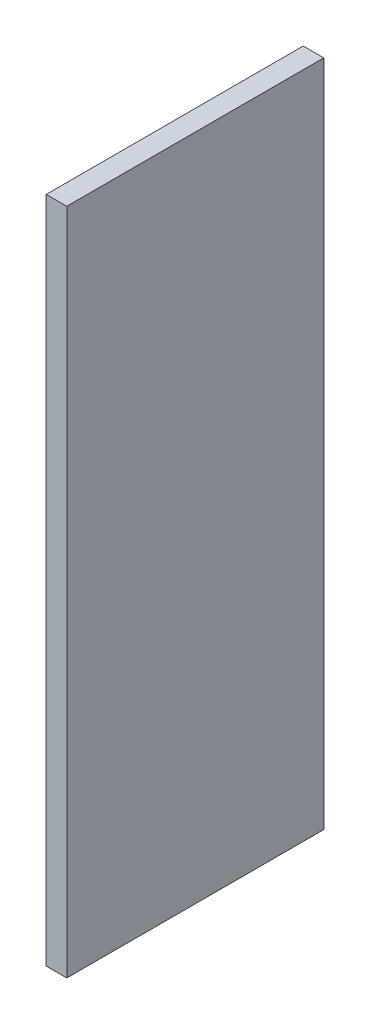
ISO-10303-21;
HEADER;
FILE_DESCRIPTION(('STEP AP214'),'2;1');
FILE_NAME('part.step','',(''),(''),'','','');
FILE_SCHEMA(('AUTOMOTIVE_DESIGN { 1 0 10303 214 1 1 1 1 }'));
ENDSEC;
DATA;
#1=APPLICATION_CONTEXT('core data for automotive mechanical design processes');
#2=APPLICATION_PROTOCOL_DEFINITION('international standard','automotive_design',2000,#1);
#3=PRODUCT_CONTEXT('',#1,'mechanical');
#4=PRODUCT('Part','Part','',(#3));
#5=PRODUCT_RELATED_PRODUCT_CATEGORY('part','',(#4));
#6=PRODUCT_DEFINITION_FORMATION('','',#4);
#7=PRODUCT_DEFINITION_CONTEXT('part definition',#1,'design');
#8=PRODUCT_DEFINITION('design','',#6,#7);
#9=PRODUCT_DEFINITION_SHAPE('','',#8);
#10=(LENGTH_UNIT() NAMED_UNIT(*) SI_UNIT(.MILLI.,.METRE.));
#11=(NAMED_UNIT(*) PLANE_ANGLE_UNIT() SI_UNIT($,.RADIAN.));
#12=(NAMED_UNIT(*) SI_UNIT($,.STERADIAN.) SOLID_ANGLE_UNIT());
#13=UNCERTAINTY_MEASURE_WITH_UNIT(LENGTH_MEASURE(1.E-05),#10,'distance_accuracy_value','');
#14=(GEOMETRIC_REPRESENTATION_CONTEXT(3) GLOBAL_UNCERTAINTY_ASSIGNED_CONTEXT((#13)) GLOBAL_UNIT_ASSIGNED_CONTEXT((#10,
#11,#12)) REPRESENTATION_CONTEXT('',''));
#15=CARTESIAN_POINT('',(0.,0.,0.));
#16=DIRECTION('',(0.,0.,1.));
#17=DIRECTION('',(1.,0.,0.));
#18=AXIS2_PLACEMENT_3D('',#15,#16,#17);
#19=CARTESIAN_POINT('',(0.,0.,5.));
#20=DIRECTION('',(1.,0.,0.));
#21=DIRECTION('',(0.,1.,0.));
#22=AXIS2_PLACEMENT_3D('',#19,#20,#21);
#23=PLANE('',#22);
#24=DIRECTION('',(0.,-1.,0.));
#25=VECTOR('',#24,1.);
#26=CARTESIAN_POINT('',(0.,0.,0.));
#27=LINE('',#26,#25);
#28=CARTESIAN_POINT('',(0.,13.,0.));
#29=VERTEX_POINT('',#28);
#30=CARTESIAN_POINT('',(0.,0.,0.));
#31=VERTEX_POINT('',#30);
#32=EDGE_CURVE('E96',#29,#31,#27,.T.);
#33=ORIENTED_EDGE('',*,*,#32,.T.);
#34=DIRECTION('',(0.,0.,-1.));
#35=VECTOR('',#34,1.);
#36=CARTESIAN_POINT('',(0.,0.,5.));
#37=LINE('',#36,#35);
#38=CARTESIAN_POINT('',(0.,0.,5.));
#39=VERTEX_POINT('',#38);
#40=EDGE_CURVE('E11',#39,#31,#37,.T.);
#41=ORIENTED_EDGE('',*,*,#40,.F.);
#42=DIRECTION('',(0.,-1.,0.));
#43=VECTOR('',#42,1.);
#44=CARTESIAN_POINT('',(0.,0.,5.));
#45=LINE('',#44,#43);
#46=CARTESIAN_POINT('',(0.,13.,5.));
#47=VERTEX_POINT('',#46);
#48=EDGE_CURVE('E84',#47,#39,#45,.T.);
#49=ORIENTED_EDGE('',*,*,#48,.F.);
#50=DIRECTION('',(0.,0.,-1.));
#51=VECTOR('',#50,1.);
#52=CARTESIAN_POINT('',(0.,13.,5.));
#53=LINE('',#52,#51);
#54=EDGE_CURVE('E92',#47,#29,#53,.T.);
#55=ORIENTED_EDGE('',*,*,#54,.T.);
#56=EDGE_LOOP('',(#33,#41,#49,#55));
#57=FACE_BOUND('',#56,.T.);
#58=ADVANCED_FACE('F33',(#57),#23,.F.);
#59=CARTESIAN_POINT('',(0.,0.,5.));
#60=DIRECTION('',(0.,1.,0.));
#61=DIRECTION('',(0.,0.,1.));
#62=AXIS2_PLACEMENT_3D('',#59,#60,#61);
#63=PLANE('',#62);
#64=DIRECTION('',(1.,0.,0.));
#65=VECTOR('',#64,1.);
#66=CARTESIAN_POINT('',(0.,0.,0.));
#67=LINE('',#66,#65);
#68=CARTESIAN_POINT('',(0.4,0.,0.));
#69=VERTEX_POINT('',#68);
#70=EDGE_CURVE('E88',#31,#69,#67,.T.);
#71=ORIENTED_EDGE('',*,*,#70,.T.);
#72=DIRECTION('',(0.,0.,-1.));
#73=VECTOR('',#72,1.);
#74=CARTESIAN_POINT('',(0.4,0.,5.));
#75=LINE('',#74,#73);
#76=CARTESIAN_POINT('',(0.4,0.,5.));
#77=VERTEX_POINT('',#76);
#78=EDGE_CURVE('E41',#77,#69,#75,.T.);
#79=ORIENTED_EDGE('',*,*,#78,.F.);
#80=DIRECTION('',(1.,0.,0.));
#81=VECTOR('',#80,1.);
#82=CARTESIAN_POINT('',(0.,0.,5.));
#83=LINE('',#82,#81);
#84=EDGE_CURVE('E79',#39,#77,#83,.T.);
#85=ORIENTED_EDGE('',*,*,#84,.F.);
#86=ORIENTED_EDGE('',*,*,#40,.T.);
#87=EDGE_LOOP('',(#71,#79,#85,#86));
#88=FACE_BOUND('',#87,.T.);
#89=ADVANCED_FACE('F87',(#88),#63,.F.);
#90=CARTESIAN_POINT('',(0.4,0.,5.));
#91=DIRECTION('',(-1.,0.,0.));
#92=DIRECTION('',(0.,-1.,0.));
#93=AXIS2_PLACEMENT_3D('',#90,#91,#92);
#94=PLANE('',#93);
#95=DIRECTION('',(0.,1.,0.));
#96=VECTOR('',#95,1.);
#97=CARTESIAN_POINT('',(0.4,0.,0.));
#98=LINE('',#97,#96);
#99=CARTESIAN_POINT('',(0.399999999999998,13.,0.));
#100=VERTEX_POINT('',#99);
#101=EDGE_CURVE('E66',#69,#100,#98,.T.);
#102=ORIENTED_EDGE('',*,*,#101,.T.);
#103=DIRECTION('',(0.,0.,-1.));
#104=VECTOR('',#103,1.);
#105=CARTESIAN_POINT('',(0.399999999999998,13.,5.));
#106=LINE('',#105,#104);
#107=CARTESIAN_POINT('',(0.399999999999998,13.,5.));
#108=VERTEX_POINT('',#107);
#109=EDGE_CURVE('E89',#108,#100,#106,.T.);
#110=ORIENTED_EDGE('',*,*,#109,.F.);
#111=DIRECTION('',(0.,1.,0.));
#112=VECTOR('',#111,1.);
#113=CARTESIAN_POINT('',(0.4,0.,5.));
#114=LINE('',#113,#112);
#115=EDGE_CURVE('E82',#77,#108,#114,.T.);
#116=ORIENTED_EDGE('',*,*,#115,.F.);
#117=ORIENTED_EDGE('',*,*,#78,.T.);
#118=EDGE_LOOP('',(#102,#110,#116,#117));
#119=FACE_BOUND('',#118,.T.);
#120=ADVANCED_FACE('F90',(#119),#94,.F.);
#121=CARTESIAN_POINT('',(0.,13.,5.));
#122=DIRECTION('',(0.,-1.,0.));
#123=DIRECTION('',(0.,0.,-1.));
#124=AXIS2_PLACEMENT_3D('',#121,#122,#123);
#125=PLANE('',#124);
#126=DIRECTION('',(-1.,0.,0.));
#127=VECTOR('',#126,1.);
#128=CARTESIAN_POINT('',(0.,13.,0.));
#129=LINE('',#128,#127);
#130=EDGE_CURVE('E72',#100,#29,#129,.T.);
#131=ORIENTED_EDGE('',*,*,#130,.T.);
#132=ORIENTED_EDGE('',*,*,#54,.F.);
#133=DIRECTION('',(-1.,0.,0.));
#134=VECTOR('',#133,1.);
#135=CARTESIAN_POINT('',(0.,13.,5.));
#136=LINE('',#135,#134);
#137=EDGE_CURVE('E49',#108,#47,#136,.T.);
#138=ORIENTED_EDGE('',*,*,#137,.F.);
#139=ORIENTED_EDGE('',*,*,#109,.T.);
#140=EDGE_LOOP('',(#131,#132,#138,#139));
#141=FACE_BOUND('',#140,.T.);
#142=ADVANCED_FACE('F103',(#141),#125,.F.);
#143=CARTESIAN_POINT('',(0.,0.,5.));
#144=DIRECTION('',(0.,0.,-1.));
#145=DIRECTION('',(-1.,0.,0.));
#146=AXIS2_PLACEMENT_3D('',#143,#144,#145);
#147=PLANE('',#146);
#148=ORIENTED_EDGE('',*,*,#48,.T.);
#149=ORIENTED_EDGE('',*,*,#84,.T.);
#150=ORIENTED_EDGE('',*,*,#115,.T.);
#151=ORIENTED_EDGE('',*,*,#137,.T.);
#152=EDGE_LOOP('',(#148,#149,#150,#151));
#153=FACE_BOUND('',#152,.T.);
#154=ADVANCED_FACE('F80',(#153),#147,.F.);
#155=CARTESIAN_POINT('',(0.,0.,0.));
#156=DIRECTION('',(0.,0.,-1.));
#157=DIRECTION('',(-1.,0.,0.));
#158=AXIS2_PLACEMENT_3D('',#155,#156,#157);
#159=PLANE('',#158);
#160=ORIENTED_EDGE('',*,*,#32,.F.);
#161=ORIENTED_EDGE('',*,*,#130,.F.);
#162=ORIENTED_EDGE('',*,*,#101,.F.);
#163=ORIENTED_EDGE('',*,*,#70,.F.);
#164=EDGE_LOOP('',(#160,#161,#162,#163));
#165=FACE_BOUND('',#164,.T.);
#166=ADVANCED_FACE('F106',(#165),#159,.T.);
#167=CLOSED_SHELL('',(#58,#89,#120,#142,#154,#166));
#168=MANIFOLD_SOLID_BREP('B2',#167);
#169=ADVANCED_BREP_SHAPE_REPRESENTATION('',(#18,#168),#14);
#170=SHAPE_DEFINITION_REPRESENTATION(#9,#169);
ENDSEC;
END-ISO-10303-21;
